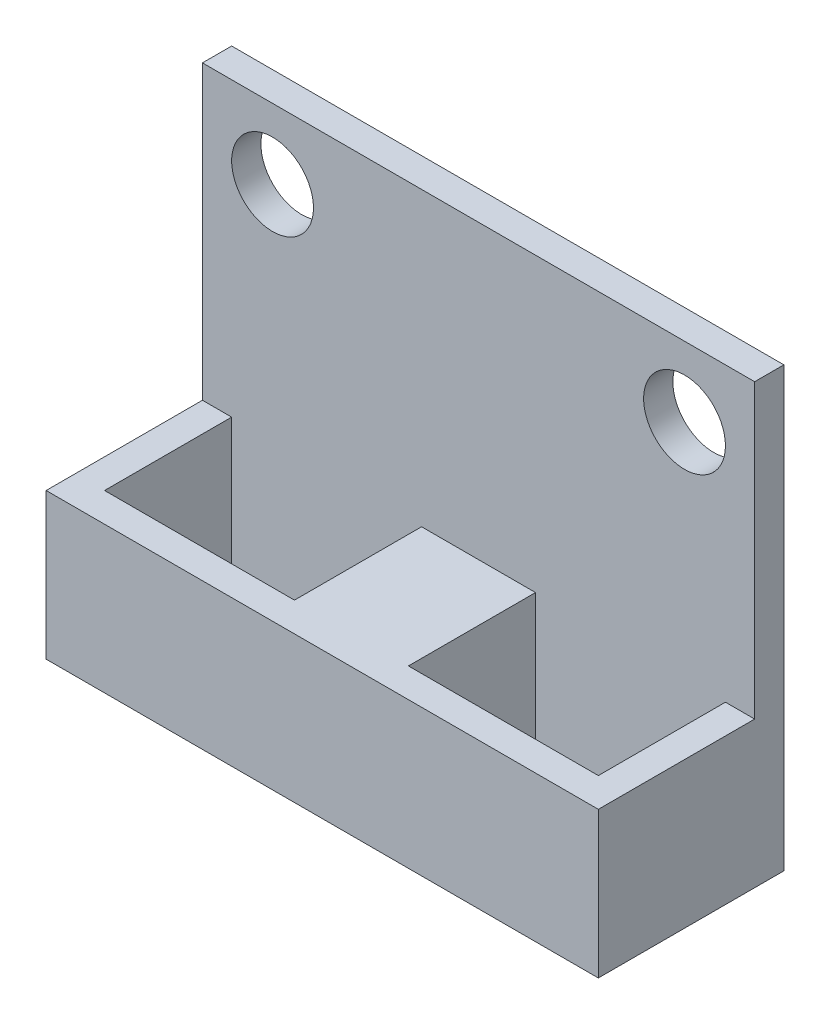
ISO-10303-21;
HEADER;
FILE_DESCRIPTION(('STEP AP214'),'2;1');
FILE_NAME('part.step','',(''),(''),'','','');
FILE_SCHEMA(('AUTOMOTIVE_DESIGN { 1 0 10303 214 1 1 1 1 }'));
ENDSEC;
DATA;
#1=APPLICATION_CONTEXT('core data for automotive mechanical design processes');
#2=APPLICATION_PROTOCOL_DEFINITION('international standard','automotive_design',2000,#1);
#3=PRODUCT_CONTEXT('',#1,'mechanical');
#4=PRODUCT('Part','Part','',(#3));
#5=PRODUCT_RELATED_PRODUCT_CATEGORY('part','',(#4));
#6=PRODUCT_DEFINITION_FORMATION('','',#4);
#7=PRODUCT_DEFINITION_CONTEXT('part definition',#1,'design');
#8=PRODUCT_DEFINITION('design','',#6,#7);
#9=PRODUCT_DEFINITION_SHAPE('','',#8);
#10=(LENGTH_UNIT() NAMED_UNIT(*) SI_UNIT(.MILLI.,.METRE.));
#11=(NAMED_UNIT(*) PLANE_ANGLE_UNIT() SI_UNIT($,.RADIAN.));
#12=(NAMED_UNIT(*) SI_UNIT($,.STERADIAN.) SOLID_ANGLE_UNIT());
#13=UNCERTAINTY_MEASURE_WITH_UNIT(LENGTH_MEASURE(1.E-05),#10,'distance_accuracy_value','');
#14=(GEOMETRIC_REPRESENTATION_CONTEXT(3) GLOBAL_UNCERTAINTY_ASSIGNED_CONTEXT((#13)) GLOBAL_UNIT_ASSIGNED_CONTEXT((#10,
#11,#12)) REPRESENTATION_CONTEXT('',''));
#15=CARTESIAN_POINT('',(0.,0.,0.));
#16=DIRECTION('',(0.,0.,1.));
#17=DIRECTION('',(1.,0.,0.));
#18=AXIS2_PLACEMENT_3D('',#15,#16,#17);
#19=CARTESIAN_POINT('',(0.,5.,0.));
#20=DIRECTION('',(0.,-1.,0.));
#21=DIRECTION('',(0.,0.,-1.));
#22=AXIS2_PLACEMENT_3D('',#19,#20,#21);
#23=PLANE('',#22);
#24=DIRECTION('',(1.,0.,0.));
#25=VECTOR('',#24,1.);
#26=CARTESIAN_POINT('',(-9.44999999999996,5.,-2.175));
#27=LINE('',#26,#25);
#28=CARTESIAN_POINT('',(-9.44999999999996,5.,-2.175));
#29=VERTEX_POINT('',#28);
#30=CARTESIAN_POINT('',(-8.45,5.,-2.175));
#31=VERTEX_POINT('',#30);
#32=EDGE_CURVE('E52',#29,#31,#27,.T.);
#33=ORIENTED_EDGE('',*,*,#32,.F.);
#34=DIRECTION('',(0.,0.,1.));
#35=VECTOR('',#34,1.);
#36=CARTESIAN_POINT('',(-9.44999999999996,5.,3.17499999999999));
#37=LINE('',#36,#35);
#38=CARTESIAN_POINT('',(-9.44999999999996,5.,3.17499999999999));
#39=VERTEX_POINT('',#38);
#40=EDGE_CURVE('E163',#29,#39,#37,.T.);
#41=ORIENTED_EDGE('',*,*,#40,.T.);
#42=DIRECTION('',(1.,0.,0.));
#43=VECTOR('',#42,1.);
#44=CARTESIAN_POINT('',(-9.44999999999996,5.,3.17499999999999));
#45=LINE('',#44,#43);
#46=CARTESIAN_POINT('',(9.45000000000004,5.,3.17499999999999));
#47=VERTEX_POINT('',#46);
#48=EDGE_CURVE('E257',#39,#47,#45,.T.);
#49=ORIENTED_EDGE('',*,*,#48,.T.);
#50=DIRECTION('',(0.,0.,-1.));
#51=VECTOR('',#50,1.);
#52=CARTESIAN_POINT('',(9.45000000000004,5.,3.17499999999999));
#53=LINE('',#52,#51);
#54=CARTESIAN_POINT('',(9.45000000000004,5.,-2.175));
#55=VERTEX_POINT('',#54);
#56=EDGE_CURVE('E252',#47,#55,#53,.T.);
#57=ORIENTED_EDGE('',*,*,#56,.T.);
#58=CARTESIAN_POINT('',(8.45,5.,-2.175));
#59=VERTEX_POINT('',#58);
#60=EDGE_CURVE('E44',#59,#55,#27,.T.);
#61=ORIENTED_EDGE('',*,*,#60,.F.);
#62=DIRECTION('',(0.,0.,-1.));
#63=VECTOR('',#62,1.);
#64=CARTESIAN_POINT('',(8.45,5.,-2.175));
#65=LINE('',#64,#63);
#66=CARTESIAN_POINT('',(8.45,5.,2.175));
#67=VERTEX_POINT('',#66);
#68=EDGE_CURVE('E198',#67,#59,#65,.T.);
#69=ORIENTED_EDGE('',*,*,#68,.F.);
#70=DIRECTION('',(1.,0.,0.));
#71=VECTOR('',#70,1.);
#72=CARTESIAN_POINT('',(1.95,5.,2.175));
#73=LINE('',#72,#71);
#74=CARTESIAN_POINT('',(1.95,5.,2.175));
#75=VERTEX_POINT('',#74);
#76=EDGE_CURVE('E197',#75,#67,#73,.T.);
#77=ORIENTED_EDGE('',*,*,#76,.F.);
#78=DIRECTION('',(0.,0.,1.));
#79=VECTOR('',#78,1.);
#80=CARTESIAN_POINT('',(1.95,5.,-2.175));
#81=LINE('',#80,#79);
#82=CARTESIAN_POINT('',(1.95,5.,-2.175));
#83=VERTEX_POINT('',#82);
#84=EDGE_CURVE('E195',#83,#75,#81,.T.);
#85=ORIENTED_EDGE('',*,*,#84,.F.);
#86=CARTESIAN_POINT('',(-1.95,5.,-2.175));
#87=VERTEX_POINT('',#86);
#88=EDGE_CURVE('E11',#87,#83,#27,.T.);
#89=ORIENTED_EDGE('',*,*,#88,.F.);
#90=DIRECTION('',(0.,0.,-1.));
#91=VECTOR('',#90,1.);
#92=CARTESIAN_POINT('',(-1.95,5.,2.175));
#93=LINE('',#92,#91);
#94=CARTESIAN_POINT('',(-1.95,5.,2.175));
#95=VERTEX_POINT('',#94);
#96=EDGE_CURVE('E176',#95,#87,#93,.T.);
#97=ORIENTED_EDGE('',*,*,#96,.F.);
#98=DIRECTION('',(1.,0.,0.));
#99=VECTOR('',#98,1.);
#100=CARTESIAN_POINT('',(-8.45,5.,2.175));
#101=LINE('',#100,#99);
#102=CARTESIAN_POINT('',(-8.45,5.,2.175));
#103=VERTEX_POINT('',#102);
#104=EDGE_CURVE('E175',#103,#95,#101,.T.);
#105=ORIENTED_EDGE('',*,*,#104,.F.);
#106=DIRECTION('',(0.,0.,1.));
#107=VECTOR('',#106,1.);
#108=CARTESIAN_POINT('',(-8.45,5.,2.175));
#109=LINE('',#108,#107);
#110=EDGE_CURVE('E172',#31,#103,#109,.T.);
#111=ORIENTED_EDGE('',*,*,#110,.F.);
#112=EDGE_LOOP('',(#33,#41,#49,#57,#61,#69,#77,#85,#89,#97,#105,#111));
#113=FACE_BOUND('',#112,.T.);
#114=ADVANCED_FACE('F35',(#113),#23,.F.);
#115=CARTESIAN_POINT('',(0.,0.,0.));
#116=DIRECTION('',(0.,-1.,0.));
#117=DIRECTION('',(0.,0.,-1.));
#118=AXIS2_PLACEMENT_3D('',#115,#116,#117);
#119=PLANE('',#118);
#120=DIRECTION('',(1.,0.,0.));
#121=VECTOR('',#120,1.);
#122=CARTESIAN_POINT('',(-8.45,0.,2.175));
#123=LINE('',#122,#121);
#124=CARTESIAN_POINT('',(-8.45,0.,2.175));
#125=VERTEX_POINT('',#124);
#126=CARTESIAN_POINT('',(-1.95,0.,2.175));
#127=VERTEX_POINT('',#126);
#128=EDGE_CURVE('E192',#125,#127,#123,.T.);
#129=ORIENTED_EDGE('',*,*,#128,.T.);
#130=DIRECTION('',(0.,0.,-1.));
#131=VECTOR('',#130,1.);
#132=CARTESIAN_POINT('',(-1.95,0.,2.175));
#133=LINE('',#132,#131);
#134=CARTESIAN_POINT('',(-1.95,0.,-2.175));
#135=VERTEX_POINT('',#134);
#136=EDGE_CURVE('E233',#127,#135,#133,.T.);
#137=ORIENTED_EDGE('',*,*,#136,.T.);
#138=DIRECTION('',(-1.,0.,0.));
#139=VECTOR('',#138,1.);
#140=CARTESIAN_POINT('',(-8.45,0.,-2.175));
#141=LINE('',#140,#139);
#142=CARTESIAN_POINT('',(-8.45,0.,-2.175));
#143=VERTEX_POINT('',#142);
#144=EDGE_CURVE('E236',#135,#143,#141,.T.);
#145=ORIENTED_EDGE('',*,*,#144,.T.);
#146=DIRECTION('',(0.,0.,1.));
#147=VECTOR('',#146,1.);
#148=CARTESIAN_POINT('',(-8.45,0.,2.175));
#149=LINE('',#148,#147);
#150=EDGE_CURVE('E239',#143,#125,#149,.T.);
#151=ORIENTED_EDGE('',*,*,#150,.T.);
#152=EDGE_LOOP('',(#129,#137,#145,#151));
#153=FACE_BOUND('',#152,.T.);
#154=DIRECTION('',(0.,0.,-1.));
#155=VECTOR('',#154,1.);
#156=CARTESIAN_POINT('',(9.45000000000004,0.,3.17499999999999));
#157=LINE('',#156,#155);
#158=CARTESIAN_POINT('',(9.45000000000004,0.,3.17499999999999));
#159=VERTEX_POINT('',#158);
#160=CARTESIAN_POINT('',(9.45000000000004,0.,-3.175));
#161=VERTEX_POINT('',#160);
#162=EDGE_CURVE('E187',#159,#161,#157,.T.);
#163=ORIENTED_EDGE('',*,*,#162,.F.);
#164=DIRECTION('',(1.,0.,0.));
#165=VECTOR('',#164,1.);
#166=CARTESIAN_POINT('',(-9.44999999999996,0.,3.17499999999999));
#167=LINE('',#166,#165);
#168=CARTESIAN_POINT('',(-9.44999999999996,0.,3.17499999999999));
#169=VERTEX_POINT('',#168);
#170=EDGE_CURVE('E254',#169,#159,#167,.T.);
#171=ORIENTED_EDGE('',*,*,#170,.F.);
#172=DIRECTION('',(0.,0.,1.));
#173=VECTOR('',#172,1.);
#174=CARTESIAN_POINT('',(-9.44999999999996,0.,3.17499999999999));
#175=LINE('',#174,#173);
#176=CARTESIAN_POINT('',(-9.44999999999996,0.,-3.175));
#177=VERTEX_POINT('',#176);
#178=EDGE_CURVE('E269',#177,#169,#175,.T.);
#179=ORIENTED_EDGE('',*,*,#178,.F.);
#180=DIRECTION('',(-1.,0.,0.));
#181=VECTOR('',#180,1.);
#182=CARTESIAN_POINT('',(-9.44999999999996,0.,-3.175));
#183=LINE('',#182,#181);
#184=EDGE_CURVE('E267',#161,#177,#183,.T.);
#185=ORIENTED_EDGE('',*,*,#184,.F.);
#186=EDGE_LOOP('',(#163,#171,#179,#185));
#187=FACE_BOUND('',#186,.T.);
#188=DIRECTION('',(1.,0.,0.));
#189=VECTOR('',#188,1.);
#190=CARTESIAN_POINT('',(1.95,0.,2.175));
#191=LINE('',#190,#189);
#192=CARTESIAN_POINT('',(1.95,0.,2.175));
#193=VERTEX_POINT('',#192);
#194=CARTESIAN_POINT('',(8.45,0.,2.175));
#195=VERTEX_POINT('',#194);
#196=EDGE_CURVE('E225',#193,#195,#191,.T.);
#197=ORIENTED_EDGE('',*,*,#196,.T.);
#198=DIRECTION('',(0.,0.,-1.));
#199=VECTOR('',#198,1.);
#200=CARTESIAN_POINT('',(8.45,0.,-2.175));
#201=LINE('',#200,#199);
#202=CARTESIAN_POINT('',(8.45,0.,-2.175));
#203=VERTEX_POINT('',#202);
#204=EDGE_CURVE('E164',#195,#203,#201,.T.);
#205=ORIENTED_EDGE('',*,*,#204,.T.);
#206=DIRECTION('',(-1.,0.,0.));
#207=VECTOR('',#206,1.);
#208=CARTESIAN_POINT('',(1.95,0.,-2.175));
#209=LINE('',#208,#207);
#210=CARTESIAN_POINT('',(1.95,0.,-2.175));
#211=VERTEX_POINT('',#210);
#212=EDGE_CURVE('E166',#203,#211,#209,.T.);
#213=ORIENTED_EDGE('',*,*,#212,.T.);
#214=DIRECTION('',(0.,0.,1.));
#215=VECTOR('',#214,1.);
#216=CARTESIAN_POINT('',(1.95,0.,-2.175));
#217=LINE('',#216,#215);
#218=EDGE_CURVE('E222',#211,#193,#217,.T.);
#219=ORIENTED_EDGE('',*,*,#218,.T.);
#220=EDGE_LOOP('',(#197,#205,#213,#219));
#221=FACE_BOUND('',#220,.T.);
#222=ADVANCED_FACE('F323',(#153,#187,#221),#119,.T.);
#223=CARTESIAN_POINT('',(9.45000000000004,5.,3.17499999999999));
#224=DIRECTION('',(-1.,0.,0.));
#225=DIRECTION('',(0.,0.,1.));
#226=AXIS2_PLACEMENT_3D('',#223,#224,#225);
#227=PLANE('',#226);
#228=ORIENTED_EDGE('',*,*,#162,.T.);
#229=DIRECTION('',(0.,-1.,0.));
#230=VECTOR('',#229,1.);
#231=CARTESIAN_POINT('',(9.45000000000004,5.,-3.175));
#232=LINE('',#231,#230);
#233=CARTESIAN_POINT('',(9.45000000000004,15.,-3.175));
#234=VERTEX_POINT('',#233);
#235=EDGE_CURVE('E255',#234,#161,#232,.T.);
#236=ORIENTED_EDGE('',*,*,#235,.F.);
#237=DIRECTION('',(0.,0.,-1.));
#238=VECTOR('',#237,1.);
#239=CARTESIAN_POINT('',(9.45000000000004,15.,-3.175));
#240=LINE('',#239,#238);
#241=CARTESIAN_POINT('',(9.45000000000004,15.,-2.175));
#242=VERTEX_POINT('',#241);
#243=EDGE_CURVE('E150',#242,#234,#240,.T.);
#244=ORIENTED_EDGE('',*,*,#243,.F.);
#245=DIRECTION('',(0.,-1.,0.));
#246=VECTOR('',#245,1.);
#247=CARTESIAN_POINT('',(9.45000000000004,15.,-2.175));
#248=LINE('',#247,#246);
#249=EDGE_CURVE('E146',#242,#55,#248,.T.);
#250=ORIENTED_EDGE('',*,*,#249,.T.);
#251=ORIENTED_EDGE('',*,*,#56,.F.);
#252=DIRECTION('',(0.,-1.,0.));
#253=VECTOR('',#252,1.);
#254=CARTESIAN_POINT('',(9.45000000000004,5.,3.17499999999999));
#255=LINE('',#254,#253);
#256=EDGE_CURVE('E258',#47,#159,#255,.T.);
#257=ORIENTED_EDGE('',*,*,#256,.T.);
#258=EDGE_LOOP('',(#228,#236,#244,#250,#251,#257));
#259=FACE_BOUND('',#258,.T.);
#260=ADVANCED_FACE('F37',(#259),#227,.F.);
#261=CARTESIAN_POINT('',(-9.44999999999996,5.,-3.175));
#262=DIRECTION('',(0.,0.,1.));
#263=DIRECTION('',(1.,0.,0.));
#264=AXIS2_PLACEMENT_3D('',#261,#262,#263);
#265=PLANE('',#264);
#266=CARTESIAN_POINT('',(-7.04999999999996,12.6,-3.175));
#267=DIRECTION('',(0.,0.,1.));
#268=DIRECTION('',(1.,0.,0.));
#269=AXIS2_PLACEMENT_3D('',#266,#267,#268);
#270=CIRCLE('',#269,1.4);
#271=CARTESIAN_POINT('',(-5.64999999999996,12.6,-3.175));
#272=VERTEX_POINT('',#271);
#273=EDGE_CURVE('E287',#272,#272,#270,.T.);
#274=ORIENTED_EDGE('',*,*,#273,.T.);
#275=EDGE_LOOP('',(#274));
#276=FACE_BOUND('',#275,.T.);
#277=CARTESIAN_POINT('',(7.05000000000004,12.6,-3.175));
#278=DIRECTION('',(0.,0.,1.));
#279=DIRECTION('',(1.,0.,0.));
#280=AXIS2_PLACEMENT_3D('',#277,#278,#279);
#281=CIRCLE('',#280,1.4);
#282=CARTESIAN_POINT('',(8.45000000000004,12.6,-3.175));
#283=VERTEX_POINT('',#282);
#284=EDGE_CURVE('E216',#283,#283,#281,.T.);
#285=ORIENTED_EDGE('',*,*,#284,.T.);
#286=EDGE_LOOP('',(#285));
#287=FACE_BOUND('',#286,.T.);
#288=ORIENTED_EDGE('',*,*,#184,.T.);
#289=DIRECTION('',(0.,-1.,0.));
#290=VECTOR('',#289,1.);
#291=CARTESIAN_POINT('',(-9.44999999999996,5.,-3.175));
#292=LINE('',#291,#290);
#293=CARTESIAN_POINT('',(-9.44999999999996,15.,-3.175));
#294=VERTEX_POINT('',#293);
#295=EDGE_CURVE('E273',#294,#177,#292,.T.);
#296=ORIENTED_EDGE('',*,*,#295,.F.);
#297=DIRECTION('',(-1.,0.,0.));
#298=VECTOR('',#297,1.);
#299=CARTESIAN_POINT('',(-9.44999999999996,15.,-3.175));
#300=LINE('',#299,#298);
#301=EDGE_CURVE('E157',#234,#294,#300,.T.);
#302=ORIENTED_EDGE('',*,*,#301,.F.);
#303=ORIENTED_EDGE('',*,*,#235,.T.);
#304=EDGE_LOOP('',(#288,#296,#302,#303));
#305=FACE_BOUND('',#304,.T.);
#306=ADVANCED_FACE('F296',(#276,#287,#305),#265,.F.);
#307=CARTESIAN_POINT('',(-9.44999999999996,5.,3.17499999999999));
#308=DIRECTION('',(1.,0.,0.));
#309=DIRECTION('',(0.,0.,-1.));
#310=AXIS2_PLACEMENT_3D('',#307,#308,#309);
#311=PLANE('',#310);
#312=ORIENTED_EDGE('',*,*,#178,.T.);
#313=DIRECTION('',(0.,-1.,0.));
#314=VECTOR('',#313,1.);
#315=CARTESIAN_POINT('',(-9.44999999999996,5.,3.17499999999999));
#316=LINE('',#315,#314);
#317=EDGE_CURVE('E262',#39,#169,#316,.T.);
#318=ORIENTED_EDGE('',*,*,#317,.F.);
#319=ORIENTED_EDGE('',*,*,#40,.F.);
#320=DIRECTION('',(0.,-1.,0.));
#321=VECTOR('',#320,1.);
#322=CARTESIAN_POINT('',(-9.44999999999996,15.,-2.175));
#323=LINE('',#322,#321);
#324=CARTESIAN_POINT('',(-9.44999999999996,15.,-2.175));
#325=VERTEX_POINT('',#324);
#326=EDGE_CURVE('E143',#325,#29,#323,.T.);
#327=ORIENTED_EDGE('',*,*,#326,.F.);
#328=DIRECTION('',(0.,0.,1.));
#329=VECTOR('',#328,1.);
#330=CARTESIAN_POINT('',(-9.44999999999996,15.,-3.175));
#331=LINE('',#330,#329);
#332=EDGE_CURVE('E151',#294,#325,#331,.T.);
#333=ORIENTED_EDGE('',*,*,#332,.F.);
#334=ORIENTED_EDGE('',*,*,#295,.T.);
#335=EDGE_LOOP('',(#312,#318,#319,#327,#333,#334));
#336=FACE_BOUND('',#335,.T.);
#337=ADVANCED_FACE('F161',(#336),#311,.F.);
#338=CARTESIAN_POINT('',(-9.44999999999996,5.,3.17499999999999));
#339=DIRECTION('',(0.,0.,-1.));
#340=DIRECTION('',(-1.,0.,0.));
#341=AXIS2_PLACEMENT_3D('',#338,#339,#340);
#342=PLANE('',#341);
#343=ORIENTED_EDGE('',*,*,#170,.T.);
#344=ORIENTED_EDGE('',*,*,#256,.F.);
#345=ORIENTED_EDGE('',*,*,#48,.F.);
#346=ORIENTED_EDGE('',*,*,#317,.T.);
#347=EDGE_LOOP('',(#343,#344,#345,#346));
#348=FACE_BOUND('',#347,.T.);
#349=ADVANCED_FACE('F332',(#348),#342,.F.);
#350=CARTESIAN_POINT('',(-1.95,5.,2.175));
#351=DIRECTION('',(-1.,0.,0.));
#352=DIRECTION('',(0.,0.,1.));
#353=AXIS2_PLACEMENT_3D('',#350,#351,#352);
#354=PLANE('',#353);
#355=ORIENTED_EDGE('',*,*,#136,.F.);
#356=DIRECTION('',(0.,-1.,0.));
#357=VECTOR('',#356,1.);
#358=CARTESIAN_POINT('',(-1.95,5.,2.175));
#359=LINE('',#358,#357);
#360=EDGE_CURVE('E232',#95,#127,#359,.T.);
#361=ORIENTED_EDGE('',*,*,#360,.F.);
#362=ORIENTED_EDGE('',*,*,#96,.T.);
#363=DIRECTION('',(0.,-1.,0.));
#364=VECTOR('',#363,1.);
#365=CARTESIAN_POINT('',(-1.95,5.,-2.175));
#366=LINE('',#365,#364);
#367=EDGE_CURVE('E181',#87,#135,#366,.T.);
#368=ORIENTED_EDGE('',*,*,#367,.T.);
#369=EDGE_LOOP('',(#355,#361,#362,#368));
#370=FACE_BOUND('',#369,.T.);
#371=ADVANCED_FACE('F309',(#370),#354,.T.);
#372=CARTESIAN_POINT('',(-8.45,5.,-2.175));
#373=DIRECTION('',(0.,0.,1.));
#374=DIRECTION('',(1.,0.,0.));
#375=AXIS2_PLACEMENT_3D('',#372,#373,#374);
#376=PLANE('',#375);
#377=CARTESIAN_POINT('',(-7.04999999999996,12.6,-2.175));
#378=DIRECTION('',(0.,0.,1.));
#379=DIRECTION('',(1.,0.,0.));
#380=AXIS2_PLACEMENT_3D('',#377,#378,#379);
#381=CIRCLE('',#380,1.4);
#382=CARTESIAN_POINT('',(-5.64999999999996,12.6,-2.175));
#383=VERTEX_POINT('',#382);
#384=EDGE_CURVE('E290',#383,#383,#381,.T.);
#385=ORIENTED_EDGE('',*,*,#384,.F.);
#386=EDGE_LOOP('',(#385));
#387=FACE_BOUND('',#386,.T.);
#388=CARTESIAN_POINT('',(7.05000000000004,12.6,-2.175));
#389=DIRECTION('',(0.,0.,1.));
#390=DIRECTION('',(1.,0.,0.));
#391=AXIS2_PLACEMENT_3D('',#388,#389,#390);
#392=CIRCLE('',#391,1.4);
#393=CARTESIAN_POINT('',(8.45000000000004,12.6,-2.175));
#394=VERTEX_POINT('',#393);
#395=EDGE_CURVE('E284',#394,#394,#392,.T.);
#396=ORIENTED_EDGE('',*,*,#395,.F.);
#397=EDGE_LOOP('',(#396));
#398=FACE_BOUND('',#397,.T.);
#399=ORIENTED_EDGE('',*,*,#144,.F.);
#400=ORIENTED_EDGE('',*,*,#367,.F.);
#401=ORIENTED_EDGE('',*,*,#88,.T.);
#402=DIRECTION('',(0.,-1.,0.));
#403=VECTOR('',#402,1.);
#404=CARTESIAN_POINT('',(1.95,5.,-2.175));
#405=LINE('',#404,#403);
#406=EDGE_CURVE('E201',#83,#211,#405,.T.);
#407=ORIENTED_EDGE('',*,*,#406,.T.);
#408=ORIENTED_EDGE('',*,*,#212,.F.);
#409=DIRECTION('',(0.,-1.,0.));
#410=VECTOR('',#409,1.);
#411=CARTESIAN_POINT('',(8.45,5.,-2.175));
#412=LINE('',#411,#410);
#413=EDGE_CURVE('E202',#59,#203,#412,.T.);
#414=ORIENTED_EDGE('',*,*,#413,.F.);
#415=ORIENTED_EDGE('',*,*,#60,.T.);
#416=ORIENTED_EDGE('',*,*,#249,.F.);
#417=DIRECTION('',(1.,0.,0.));
#418=VECTOR('',#417,1.);
#419=CARTESIAN_POINT('',(-9.44999999999996,15.,-2.175));
#420=LINE('',#419,#418);
#421=EDGE_CURVE('E139',#325,#242,#420,.T.);
#422=ORIENTED_EDGE('',*,*,#421,.F.);
#423=ORIENTED_EDGE('',*,*,#326,.T.);
#424=ORIENTED_EDGE('',*,*,#32,.T.);
#425=DIRECTION('',(0.,-1.,0.));
#426=VECTOR('',#425,1.);
#427=CARTESIAN_POINT('',(-8.45,5.,-2.175));
#428=LINE('',#427,#426);
#429=EDGE_CURVE('E179',#31,#143,#428,.T.);
#430=ORIENTED_EDGE('',*,*,#429,.T.);
#431=EDGE_LOOP('',(#399,#400,#401,#407,#408,#414,#415,#416,#422,#423,#424,#430));
#432=FACE_BOUND('',#431,.T.);
#433=ADVANCED_FACE('F141',(#387,#398,#432),#376,.T.);
#434=CARTESIAN_POINT('',(-8.45,5.,2.175));
#435=DIRECTION('',(1.,0.,0.));
#436=DIRECTION('',(0.,0.,-1.));
#437=AXIS2_PLACEMENT_3D('',#434,#435,#436);
#438=PLANE('',#437);
#439=ORIENTED_EDGE('',*,*,#150,.F.);
#440=ORIENTED_EDGE('',*,*,#429,.F.);
#441=ORIENTED_EDGE('',*,*,#110,.T.);
#442=DIRECTION('',(0.,-1.,0.));
#443=VECTOR('',#442,1.);
#444=CARTESIAN_POINT('',(-8.45,5.,2.175));
#445=LINE('',#444,#443);
#446=EDGE_CURVE('E182',#103,#125,#445,.T.);
#447=ORIENTED_EDGE('',*,*,#446,.T.);
#448=EDGE_LOOP('',(#439,#440,#441,#447));
#449=FACE_BOUND('',#448,.T.);
#450=ADVANCED_FACE('F308',(#449),#438,.T.);
#451=CARTESIAN_POINT('',(-8.45,5.,2.175));
#452=DIRECTION('',(0.,0.,-1.));
#453=DIRECTION('',(-1.,0.,0.));
#454=AXIS2_PLACEMENT_3D('',#451,#452,#453);
#455=PLANE('',#454);
#456=ORIENTED_EDGE('',*,*,#128,.F.);
#457=ORIENTED_EDGE('',*,*,#446,.F.);
#458=ORIENTED_EDGE('',*,*,#104,.T.);
#459=ORIENTED_EDGE('',*,*,#360,.T.);
#460=EDGE_LOOP('',(#456,#457,#458,#459));
#461=FACE_BOUND('',#460,.T.);
#462=ADVANCED_FACE('F363',(#461),#455,.T.);
#463=CARTESIAN_POINT('',(8.45,5.,-2.175));
#464=DIRECTION('',(-1.,0.,0.));
#465=DIRECTION('',(0.,0.,1.));
#466=AXIS2_PLACEMENT_3D('',#463,#464,#465);
#467=PLANE('',#466);
#468=ORIENTED_EDGE('',*,*,#204,.F.);
#469=DIRECTION('',(0.,-1.,0.));
#470=VECTOR('',#469,1.);
#471=CARTESIAN_POINT('',(8.45,5.,2.175));
#472=LINE('',#471,#470);
#473=EDGE_CURVE('E218',#67,#195,#472,.T.);
#474=ORIENTED_EDGE('',*,*,#473,.F.);
#475=ORIENTED_EDGE('',*,*,#68,.T.);
#476=ORIENTED_EDGE('',*,*,#413,.T.);
#477=EDGE_LOOP('',(#468,#474,#475,#476));
#478=FACE_BOUND('',#477,.T.);
#479=ADVANCED_FACE('F368',(#478),#467,.T.);
#480=CARTESIAN_POINT('',(1.95,5.,-2.175));
#481=DIRECTION('',(1.,0.,0.));
#482=DIRECTION('',(0.,0.,-1.));
#483=AXIS2_PLACEMENT_3D('',#480,#481,#482);
#484=PLANE('',#483);
#485=ORIENTED_EDGE('',*,*,#218,.F.);
#486=ORIENTED_EDGE('',*,*,#406,.F.);
#487=ORIENTED_EDGE('',*,*,#84,.T.);
#488=DIRECTION('',(0.,-1.,0.));
#489=VECTOR('',#488,1.);
#490=CARTESIAN_POINT('',(1.95,5.,2.175));
#491=LINE('',#490,#489);
#492=EDGE_CURVE('E60',#75,#193,#491,.T.);
#493=ORIENTED_EDGE('',*,*,#492,.T.);
#494=EDGE_LOOP('',(#485,#486,#487,#493));
#495=FACE_BOUND('',#494,.T.);
#496=ADVANCED_FACE('F381',(#495),#484,.T.);
#497=CARTESIAN_POINT('',(1.95,5.,2.175));
#498=DIRECTION('',(0.,0.,-1.));
#499=DIRECTION('',(-1.,0.,0.));
#500=AXIS2_PLACEMENT_3D('',#497,#498,#499);
#501=PLANE('',#500);
#502=ORIENTED_EDGE('',*,*,#196,.F.);
#503=ORIENTED_EDGE('',*,*,#492,.F.);
#504=ORIENTED_EDGE('',*,*,#76,.T.);
#505=ORIENTED_EDGE('',*,*,#473,.T.);
#506=EDGE_LOOP('',(#502,#503,#504,#505));
#507=FACE_BOUND('',#506,.T.);
#508=ADVANCED_FACE('F319',(#507),#501,.T.);
#509=CARTESIAN_POINT('',(0.,15.,0.));
#510=DIRECTION('',(0.,1.,0.));
#511=DIRECTION('',(0.,0.,1.));
#512=AXIS2_PLACEMENT_3D('',#509,#510,#511);
#513=PLANE('',#512);
#514=ORIENTED_EDGE('',*,*,#332,.T.);
#515=ORIENTED_EDGE('',*,*,#421,.T.);
#516=ORIENTED_EDGE('',*,*,#243,.T.);
#517=ORIENTED_EDGE('',*,*,#301,.T.);
#518=EDGE_LOOP('',(#514,#515,#516,#517));
#519=FACE_BOUND('',#518,.T.);
#520=ADVANCED_FACE('F155',(#519),#513,.T.);
#521=CARTESIAN_POINT('',(7.05000000000004,12.6,-3.175));
#522=DIRECTION('',(0.,0.,1.));
#523=DIRECTION('',(1.,0.,0.));
#524=AXIS2_PLACEMENT_3D('',#521,#522,#523);
#525=CYLINDRICAL_SURFACE('',#524,1.4);
#526=ORIENTED_EDGE('',*,*,#284,.F.);
#527=EDGE_LOOP('',(#526));
#528=FACE_BOUND('',#527,.T.);
#529=ORIENTED_EDGE('',*,*,#395,.T.);
#530=EDGE_LOOP('',(#529));
#531=FACE_BOUND('',#530,.T.);
#532=ADVANCED_FACE('F302',(#528,#531),#525,.F.);
#533=CARTESIAN_POINT('',(-7.04999999999996,12.6,-3.175));
#534=DIRECTION('',(0.,0.,1.));
#535=DIRECTION('',(1.,0.,0.));
#536=AXIS2_PLACEMENT_3D('',#533,#534,#535);
#537=CYLINDRICAL_SURFACE('',#536,1.4);
#538=ORIENTED_EDGE('',*,*,#273,.F.);
#539=EDGE_LOOP('',(#538));
#540=FACE_BOUND('',#539,.T.);
#541=ORIENTED_EDGE('',*,*,#384,.T.);
#542=EDGE_LOOP('',(#541));
#543=FACE_BOUND('',#542,.T.);
#544=ADVANCED_FACE('F299',(#540,#543),#537,.F.);
#545=CLOSED_SHELL('',(#114,#222,#260,#306,#337,#349,#371,#433,#450,#462,#479,#496,#508,#520,
#532,#544));
#546=MANIFOLD_SOLID_BREP('B2',#545);
#547=ADVANCED_BREP_SHAPE_REPRESENTATION('',(#18,#546),#14);
#548=SHAPE_DEFINITION_REPRESENTATION(#9,#547);
ENDSEC;
END-ISO-10303-21;
